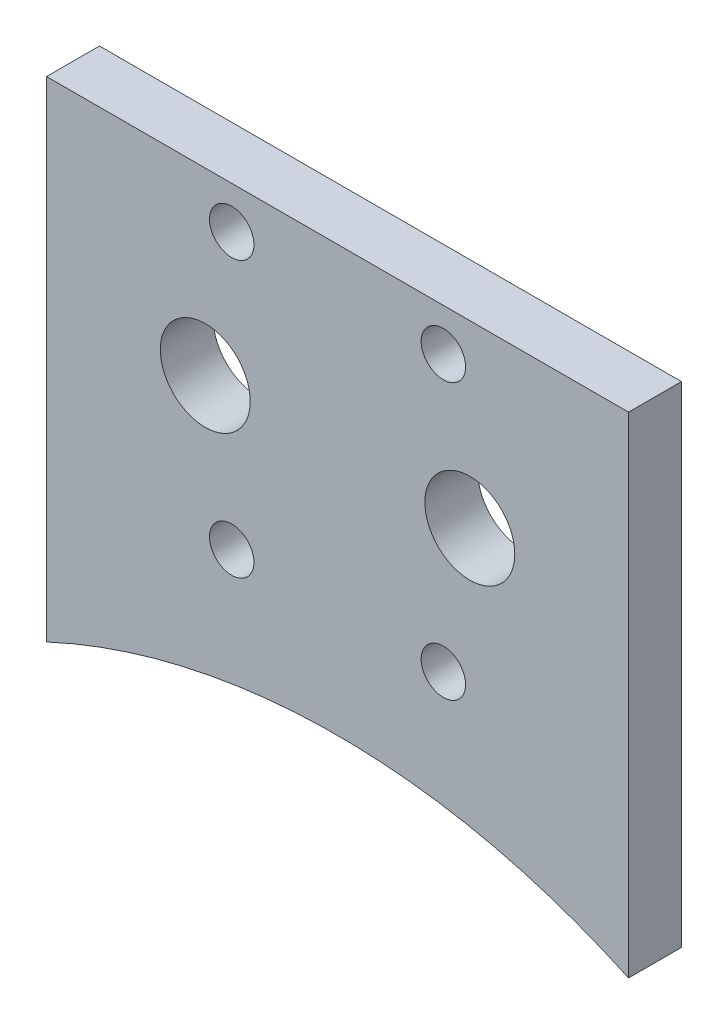
ISO-10303-21;
HEADER;
FILE_DESCRIPTION(('STEP AP214'),'2;1');
FILE_NAME('part.step','',(''),(''),'','','');
FILE_SCHEMA(('AUTOMOTIVE_DESIGN { 1 0 10303 214 1 1 1 1 }'));
ENDSEC;
DATA;
#1=APPLICATION_CONTEXT('core data for automotive mechanical design processes');
#2=APPLICATION_PROTOCOL_DEFINITION('international standard','automotive_design',2000,#1);
#3=PRODUCT_CONTEXT('',#1,'mechanical');
#4=PRODUCT('Part','Part','',(#3));
#5=PRODUCT_RELATED_PRODUCT_CATEGORY('part','',(#4));
#6=PRODUCT_DEFINITION_FORMATION('','',#4);
#7=PRODUCT_DEFINITION_CONTEXT('part definition',#1,'design');
#8=PRODUCT_DEFINITION('design','',#6,#7);
#9=PRODUCT_DEFINITION_SHAPE('','',#8);
#10=(LENGTH_UNIT() NAMED_UNIT(*) SI_UNIT(.MILLI.,.METRE.));
#11=(NAMED_UNIT(*) PLANE_ANGLE_UNIT() SI_UNIT($,.RADIAN.));
#12=(NAMED_UNIT(*) SI_UNIT($,.STERADIAN.) SOLID_ANGLE_UNIT());
#13=UNCERTAINTY_MEASURE_WITH_UNIT(LENGTH_MEASURE(1.E-05),#10,'distance_accuracy_value','');
#14=(GEOMETRIC_REPRESENTATION_CONTEXT(3) GLOBAL_UNCERTAINTY_ASSIGNED_CONTEXT((#13)) GLOBAL_UNIT_ASSIGNED_CONTEXT((#10,
#11,#12)) REPRESENTATION_CONTEXT('',''));
#15=CARTESIAN_POINT('',(0.,0.,0.));
#16=DIRECTION('',(0.,0.,1.));
#17=DIRECTION('',(1.,0.,0.));
#18=AXIS2_PLACEMENT_3D('',#15,#16,#17);
#19=CARTESIAN_POINT('',(0.0823984615384559,-88.7275100518437,5.));
#20=DIRECTION('',(0.,0.,1.));
#21=DIRECTION('',(1.,0.,0.));
#22=AXIS2_PLACEMENT_3D('',#19,#20,#21);
#23=PLANE('',#22);
#24=DIRECTION('',(-0.999999793655865,-0.000642408146284538,0.));
#25=VECTOR('',#24,1.);
#26=CARTESIAN_POINT('',(-27.4176015384619,16.4448156377795,5.));
#27=LINE('',#26,#25);
#28=CARTESIAN_POINT('',(27.5823984615396,16.4801480931158,5.));
#29=VERTEX_POINT('',#28);
#30=CARTESIAN_POINT('',(-27.4176015384619,16.4448156377795,5.));
#31=VERTEX_POINT('',#30);
#32=EDGE_CURVE('E71',#29,#31,#27,.T.);
#33=ORIENTED_EDGE('',*,*,#32,.T.);
#34=DIRECTION('',(0.,1.,0.));
#35=VECTOR('',#34,1.);
#36=CARTESIAN_POINT('',(-27.4176015384619,30.1685848951049,5.));
#37=LINE('',#36,#35);
#38=CARTESIAN_POINT('',(-27.4176015384619,-29.8314151048951,5.));
#39=VERTEX_POINT('',#38);
#40=EDGE_CURVE('E93',#39,#31,#37,.T.);
#41=ORIENTED_EDGE('',*,*,#40,.F.);
#42=CARTESIAN_POINT('',(0.0823984615384559,-88.7275100518437,5.));
#43=DIRECTION('',(0.,0.,-1.));
#44=DIRECTION('',(1.,0.,0.));
#45=AXIS2_PLACEMENT_3D('',#42,#43,#44);
#46=CIRCLE('',#45,65.);
#47=CARTESIAN_POINT('',(27.5823984615396,-29.8314151048951,5.));
#48=VERTEX_POINT('',#47);
#49=EDGE_CURVE('E91',#39,#48,#46,.T.);
#50=ORIENTED_EDGE('',*,*,#49,.T.);
#51=DIRECTION('',(0.,-1.,0.));
#52=VECTOR('',#51,1.);
#53=CARTESIAN_POINT('',(27.5823984615396,30.1685848951049,5.));
#54=LINE('',#53,#52);
#55=EDGE_CURVE('E85',#29,#48,#54,.T.);
#56=ORIENTED_EDGE('',*,*,#55,.F.);
#57=EDGE_LOOP('',(#33,#41,#50,#56));
#58=FACE_BOUND('',#57,.T.);
#59=CARTESIAN_POINT('',(-9.91760153846116,12.4801480931158,5.));
#60=DIRECTION('',(0.,0.,1.));
#61=DIRECTION('',(1.,0.,0.));
#62=AXIS2_PLACEMENT_3D('',#59,#60,#61);
#63=CIRCLE('',#62,2.1);
#64=CARTESIAN_POINT('',(-7.81760153846116,12.4801480931158,5.));
#65=VERTEX_POINT('',#64);
#66=EDGE_CURVE('E107',#65,#65,#63,.T.);
#67=ORIENTED_EDGE('',*,*,#66,.F.);
#68=EDGE_LOOP('',(#67));
#69=FACE_BOUND('',#68,.T.);
#70=CARTESIAN_POINT('',(-9.91760153846117,-13.5198519068842,5.));
#71=DIRECTION('',(0.,0.,1.));
#72=DIRECTION('',(1.,0.,0.));
#73=AXIS2_PLACEMENT_3D('',#70,#71,#72);
#74=CIRCLE('',#73,2.09999999999999);
#75=CARTESIAN_POINT('',(-7.81760153846118,-13.5198519068842,5.));
#76=VERTEX_POINT('',#75);
#77=EDGE_CURVE('E119',#76,#76,#74,.T.);
#78=ORIENTED_EDGE('',*,*,#77,.F.);
#79=EDGE_LOOP('',(#78));
#80=FACE_BOUND('',#79,.T.);
#81=CARTESIAN_POINT('',(12.5823984615388,-0.519851906884222,5.));
#82=DIRECTION('',(0.,0.,1.));
#83=DIRECTION('',(1.,0.,0.));
#84=AXIS2_PLACEMENT_3D('',#81,#82,#83);
#85=CIRCLE('',#84,4.25);
#86=CARTESIAN_POINT('',(16.8323984615388,-0.519851906884222,5.));
#87=VERTEX_POINT('',#86);
#88=EDGE_CURVE('E131',#87,#87,#85,.T.);
#89=ORIENTED_EDGE('',*,*,#88,.F.);
#90=EDGE_LOOP('',(#89));
#91=FACE_BOUND('',#90,.T.);
#92=CARTESIAN_POINT('',(10.0823984615388,-13.5198519068842,5.));
#93=DIRECTION('',(0.,0.,1.));
#94=DIRECTION('',(1.,0.,0.));
#95=AXIS2_PLACEMENT_3D('',#92,#93,#94);
#96=CIRCLE('',#95,2.1);
#97=CARTESIAN_POINT('',(12.1823984615388,-13.5198519068842,5.));
#98=VERTEX_POINT('',#97);
#99=EDGE_CURVE('E125',#98,#98,#96,.T.);
#100=ORIENTED_EDGE('',*,*,#99,.F.);
#101=EDGE_LOOP('',(#100));
#102=FACE_BOUND('',#101,.T.);
#103=CARTESIAN_POINT('',(-12.4176015384612,-0.519851906884215,5.));
#104=DIRECTION('',(0.,0.,1.));
#105=DIRECTION('',(1.,0.,0.));
#106=AXIS2_PLACEMENT_3D('',#103,#104,#105);
#107=CIRCLE('',#106,4.25);
#108=CARTESIAN_POINT('',(-8.16760153846116,-0.519851906884215,5.));
#109=VERTEX_POINT('',#108);
#110=EDGE_CURVE('E113',#109,#109,#107,.T.);
#111=ORIENTED_EDGE('',*,*,#110,.F.);
#112=EDGE_LOOP('',(#111));
#113=FACE_BOUND('',#112,.T.);
#114=CARTESIAN_POINT('',(10.0823984615388,12.4801480931158,5.));
#115=DIRECTION('',(0.,0.,1.));
#116=DIRECTION('',(1.,0.,0.));
#117=AXIS2_PLACEMENT_3D('',#114,#115,#116);
#118=CIRCLE('',#117,2.09999999999999);
#119=CARTESIAN_POINT('',(12.1823984615388,12.4801480931158,5.));
#120=VERTEX_POINT('',#119);
#121=EDGE_CURVE('E101',#120,#120,#118,.T.);
#122=ORIENTED_EDGE('',*,*,#121,.F.);
#123=EDGE_LOOP('',(#122));
#124=FACE_BOUND('',#123,.T.);
#125=ADVANCED_FACE('F33',(#58,#69,#80,#91,#102,#113,#124),#23,.T.);
#126=CARTESIAN_POINT('',(0.0823984615384559,-88.7275100518437,0.));
#127=DIRECTION('',(0.,0.,1.));
#128=DIRECTION('',(1.,0.,0.));
#129=AXIS2_PLACEMENT_3D('',#126,#127,#128);
#130=PLANE('',#129);
#131=DIRECTION('',(0.,1.,0.));
#132=VECTOR('',#131,1.);
#133=CARTESIAN_POINT('',(-27.4176015384619,-88.7275100518437,0.));
#134=LINE('',#133,#132);
#135=CARTESIAN_POINT('',(-27.4176015384619,-29.8314151048951,0.));
#136=VERTEX_POINT('',#135);
#137=CARTESIAN_POINT('',(-27.4176015384619,16.4448156377795,0.));
#138=VERTEX_POINT('',#137);
#139=EDGE_CURVE('E55',#136,#138,#134,.T.);
#140=ORIENTED_EDGE('',*,*,#139,.T.);
#141=DIRECTION('',(-0.999999793655865,-0.000642408146284538,0.));
#142=VECTOR('',#141,1.);
#143=CARTESIAN_POINT('',(-27.4176015384619,16.4448156377795,0.));
#144=LINE('',#143,#142);
#145=CARTESIAN_POINT('',(27.5823984615396,16.4801480931158,0.));
#146=VERTEX_POINT('',#145);
#147=EDGE_CURVE('E48',#146,#138,#144,.T.);
#148=ORIENTED_EDGE('',*,*,#147,.F.);
#149=DIRECTION('',(0.,-1.,0.));
#150=VECTOR('',#149,1.);
#151=CARTESIAN_POINT('',(27.5823984615396,-88.7275100518437,0.));
#152=LINE('',#151,#150);
#153=CARTESIAN_POINT('',(27.5823984615396,-29.8314151048951,0.));
#154=VERTEX_POINT('',#153);
#155=EDGE_CURVE('E87',#146,#154,#152,.T.);
#156=ORIENTED_EDGE('',*,*,#155,.T.);
#157=CARTESIAN_POINT('',(0.0823984615384559,-88.7275100518437,0.));
#158=DIRECTION('',(0.,0.,-1.));
#159=DIRECTION('',(1.,0.,0.));
#160=AXIS2_PLACEMENT_3D('',#157,#158,#159);
#161=CIRCLE('',#160,65.);
#162=EDGE_CURVE('E134',#136,#154,#161,.T.);
#163=ORIENTED_EDGE('',*,*,#162,.F.);
#164=EDGE_LOOP('',(#140,#148,#156,#163));
#165=FACE_BOUND('',#164,.T.);
#166=CARTESIAN_POINT('',(12.5823984615388,-0.519851906884222,0.));
#167=DIRECTION('',(0.,0.,1.));
#168=DIRECTION('',(1.,0.,0.));
#169=AXIS2_PLACEMENT_3D('',#166,#167,#168);
#170=CIRCLE('',#169,4.25);
#171=CARTESIAN_POINT('',(16.8323984615388,-0.519851906884222,0.));
#172=VERTEX_POINT('',#171);
#173=EDGE_CURVE('E128',#172,#172,#170,.T.);
#174=ORIENTED_EDGE('',*,*,#173,.T.);
#175=EDGE_LOOP('',(#174));
#176=FACE_BOUND('',#175,.T.);
#177=CARTESIAN_POINT('',(10.0823984615388,-13.5198519068842,0.));
#178=DIRECTION('',(0.,0.,1.));
#179=DIRECTION('',(1.,0.,0.));
#180=AXIS2_PLACEMENT_3D('',#177,#178,#179);
#181=CIRCLE('',#180,2.1);
#182=CARTESIAN_POINT('',(12.1823984615388,-13.5198519068842,0.));
#183=VERTEX_POINT('',#182);
#184=EDGE_CURVE('E122',#183,#183,#181,.T.);
#185=ORIENTED_EDGE('',*,*,#184,.T.);
#186=EDGE_LOOP('',(#185));
#187=FACE_BOUND('',#186,.T.);
#188=CARTESIAN_POINT('',(-9.91760153846117,-13.5198519068842,0.));
#189=DIRECTION('',(0.,0.,1.));
#190=DIRECTION('',(1.,0.,0.));
#191=AXIS2_PLACEMENT_3D('',#188,#189,#190);
#192=CIRCLE('',#191,2.09999999999999);
#193=CARTESIAN_POINT('',(-7.81760153846118,-13.5198519068842,0.));
#194=VERTEX_POINT('',#193);
#195=EDGE_CURVE('E116',#194,#194,#192,.T.);
#196=ORIENTED_EDGE('',*,*,#195,.T.);
#197=EDGE_LOOP('',(#196));
#198=FACE_BOUND('',#197,.T.);
#199=CARTESIAN_POINT('',(-12.4176015384612,-0.519851906884215,0.));
#200=DIRECTION('',(0.,0.,1.));
#201=DIRECTION('',(1.,0.,0.));
#202=AXIS2_PLACEMENT_3D('',#199,#200,#201);
#203=CIRCLE('',#202,4.25);
#204=CARTESIAN_POINT('',(-8.16760153846116,-0.519851906884215,0.));
#205=VERTEX_POINT('',#204);
#206=EDGE_CURVE('E110',#205,#205,#203,.T.);
#207=ORIENTED_EDGE('',*,*,#206,.T.);
#208=EDGE_LOOP('',(#207));
#209=FACE_BOUND('',#208,.T.);
#210=CARTESIAN_POINT('',(-9.91760153846116,12.4801480931158,0.));
#211=DIRECTION('',(0.,0.,1.));
#212=DIRECTION('',(1.,0.,0.));
#213=AXIS2_PLACEMENT_3D('',#210,#211,#212);
#214=CIRCLE('',#213,2.1);
#215=CARTESIAN_POINT('',(-7.81760153846116,12.4801480931158,0.));
#216=VERTEX_POINT('',#215);
#217=EDGE_CURVE('E104',#216,#216,#214,.T.);
#218=ORIENTED_EDGE('',*,*,#217,.T.);
#219=EDGE_LOOP('',(#218));
#220=FACE_BOUND('',#219,.T.);
#221=CARTESIAN_POINT('',(10.0823984615388,12.4801480931158,0.));
#222=DIRECTION('',(0.,0.,1.));
#223=DIRECTION('',(1.,0.,0.));
#224=AXIS2_PLACEMENT_3D('',#221,#222,#223);
#225=CIRCLE('',#224,2.09999999999999);
#226=CARTESIAN_POINT('',(12.1823984615388,12.4801480931158,0.));
#227=VERTEX_POINT('',#226);
#228=EDGE_CURVE('E100',#227,#227,#225,.T.);
#229=ORIENTED_EDGE('',*,*,#228,.T.);
#230=EDGE_LOOP('',(#229));
#231=FACE_BOUND('',#230,.T.);
#232=ADVANCED_FACE('F142',(#165,#176,#187,#198,#209,#220,#231),#130,.F.);
#233=CARTESIAN_POINT('',(0.0823984615384559,-88.7275100518437,5.));
#234=DIRECTION('',(0.,0.,-1.));
#235=DIRECTION('',(-1.,0.,0.));
#236=AXIS2_PLACEMENT_3D('',#233,#234,#235);
#237=CYLINDRICAL_SURFACE('',#236,65.);
#238=ORIENTED_EDGE('',*,*,#162,.T.);
#239=DIRECTION('',(0.,0.,-1.));
#240=VECTOR('',#239,1.);
#241=CARTESIAN_POINT('',(27.5823984615388,-29.8314151048951,5.));
#242=LINE('',#241,#240);
#243=EDGE_CURVE('E41',#48,#154,#242,.T.);
#244=ORIENTED_EDGE('',*,*,#243,.F.);
#245=ORIENTED_EDGE('',*,*,#49,.F.);
#246=DIRECTION('',(0.,0.,-1.));
#247=VECTOR('',#246,1.);
#248=CARTESIAN_POINT('',(-27.4176015384619,-29.8314151048951,5.));
#249=LINE('',#248,#247);
#250=EDGE_CURVE('E11',#39,#136,#249,.T.);
#251=ORIENTED_EDGE('',*,*,#250,.T.);
#252=EDGE_LOOP('',(#238,#244,#245,#251));
#253=FACE_BOUND('',#252,.T.);
#254=ADVANCED_FACE('F35',(#253),#237,.F.);
#255=CARTESIAN_POINT('',(12.5823984615388,-0.519851906884222,5.));
#256=DIRECTION('',(0.,0.,-1.));
#257=DIRECTION('',(-1.,0.,0.));
#258=AXIS2_PLACEMENT_3D('',#255,#256,#257);
#259=CYLINDRICAL_SURFACE('',#258,4.25);
#260=ORIENTED_EDGE('',*,*,#88,.T.);
#261=EDGE_LOOP('',(#260));
#262=FACE_BOUND('',#261,.T.);
#263=ORIENTED_EDGE('',*,*,#173,.F.);
#264=EDGE_LOOP('',(#263));
#265=FACE_BOUND('',#264,.T.);
#266=ADVANCED_FACE('F179',(#262,#265),#259,.F.);
#267=CARTESIAN_POINT('',(10.0823984615388,-13.5198519068842,5.));
#268=DIRECTION('',(0.,0.,-1.));
#269=DIRECTION('',(-1.,0.,0.));
#270=AXIS2_PLACEMENT_3D('',#267,#268,#269);
#271=CYLINDRICAL_SURFACE('',#270,2.1);
#272=ORIENTED_EDGE('',*,*,#99,.T.);
#273=EDGE_LOOP('',(#272));
#274=FACE_BOUND('',#273,.T.);
#275=ORIENTED_EDGE('',*,*,#184,.F.);
#276=EDGE_LOOP('',(#275));
#277=FACE_BOUND('',#276,.T.);
#278=ADVANCED_FACE('F182',(#274,#277),#271,.F.);
#279=CARTESIAN_POINT('',(-9.91760153846117,-13.5198519068842,5.));
#280=DIRECTION('',(0.,0.,-1.));
#281=DIRECTION('',(-1.,0.,0.));
#282=AXIS2_PLACEMENT_3D('',#279,#280,#281);
#283=CYLINDRICAL_SURFACE('',#282,2.09999999999999);
#284=ORIENTED_EDGE('',*,*,#77,.T.);
#285=EDGE_LOOP('',(#284));
#286=FACE_BOUND('',#285,.T.);
#287=ORIENTED_EDGE('',*,*,#195,.F.);
#288=EDGE_LOOP('',(#287));
#289=FACE_BOUND('',#288,.T.);
#290=ADVANCED_FACE('F186',(#286,#289),#283,.F.);
#291=CARTESIAN_POINT('',(-12.4176015384612,-0.519851906884215,5.));
#292=DIRECTION('',(0.,0.,-1.));
#293=DIRECTION('',(-1.,0.,0.));
#294=AXIS2_PLACEMENT_3D('',#291,#292,#293);
#295=CYLINDRICAL_SURFACE('',#294,4.25);
#296=ORIENTED_EDGE('',*,*,#110,.T.);
#297=EDGE_LOOP('',(#296));
#298=FACE_BOUND('',#297,.T.);
#299=ORIENTED_EDGE('',*,*,#206,.F.);
#300=EDGE_LOOP('',(#299));
#301=FACE_BOUND('',#300,.T.);
#302=ADVANCED_FACE('F170',(#298,#301),#295,.F.);
#303=CARTESIAN_POINT('',(-9.91760153846116,12.4801480931158,5.));
#304=DIRECTION('',(0.,0.,-1.));
#305=DIRECTION('',(-1.,0.,0.));
#306=AXIS2_PLACEMENT_3D('',#303,#304,#305);
#307=CYLINDRICAL_SURFACE('',#306,2.1);
#308=ORIENTED_EDGE('',*,*,#66,.T.);
#309=EDGE_LOOP('',(#308));
#310=FACE_BOUND('',#309,.T.);
#311=ORIENTED_EDGE('',*,*,#217,.F.);
#312=EDGE_LOOP('',(#311));
#313=FACE_BOUND('',#312,.T.);
#314=ADVANCED_FACE('F160',(#310,#313),#307,.F.);
#315=CARTESIAN_POINT('',(10.0823984615388,12.4801480931158,5.));
#316=DIRECTION('',(0.,0.,-1.));
#317=DIRECTION('',(-1.,0.,0.));
#318=AXIS2_PLACEMENT_3D('',#315,#316,#317);
#319=CYLINDRICAL_SURFACE('',#318,2.09999999999999);
#320=ORIENTED_EDGE('',*,*,#121,.T.);
#321=EDGE_LOOP('',(#320));
#322=FACE_BOUND('',#321,.T.);
#323=ORIENTED_EDGE('',*,*,#228,.F.);
#324=EDGE_LOOP('',(#323));
#325=FACE_BOUND('',#324,.T.);
#326=ADVANCED_FACE('F158',(#322,#325),#319,.F.);
#327=CARTESIAN_POINT('',(27.5823984615396,30.1685848951049,-5.));
#328=DIRECTION('',(-1.,0.,0.));
#329=DIRECTION('',(0.,0.,1.));
#330=AXIS2_PLACEMENT_3D('',#327,#328,#329);
#331=PLANE('',#330);
#332=ORIENTED_EDGE('',*,*,#155,.F.);
#333=DIRECTION('',(0.,0.,-1.));
#334=VECTOR('',#333,1.);
#335=CARTESIAN_POINT('',(27.5823984615396,16.4801480931158,5.));
#336=LINE('',#335,#334);
#337=EDGE_CURVE('E74',#29,#146,#336,.T.);
#338=ORIENTED_EDGE('',*,*,#337,.F.);
#339=ORIENTED_EDGE('',*,*,#55,.T.);
#340=ORIENTED_EDGE('',*,*,#243,.T.);
#341=EDGE_LOOP('',(#332,#338,#339,#340));
#342=FACE_BOUND('',#341,.T.);
#343=ADVANCED_FACE('F83',(#342),#331,.F.);
#344=CARTESIAN_POINT('',(-27.4176015384619,30.1685848951049,-5.));
#345=DIRECTION('',(1.,0.,0.));
#346=DIRECTION('',(0.,0.,-1.));
#347=AXIS2_PLACEMENT_3D('',#344,#345,#346);
#348=PLANE('',#347);
#349=ORIENTED_EDGE('',*,*,#40,.T.);
#350=DIRECTION('',(0.,0.,-1.));
#351=VECTOR('',#350,1.);
#352=CARTESIAN_POINT('',(-27.4176015384619,16.4448156377795,5.));
#353=LINE('',#352,#351);
#354=EDGE_CURVE('E75',#31,#138,#353,.T.);
#355=ORIENTED_EDGE('',*,*,#354,.T.);
#356=ORIENTED_EDGE('',*,*,#139,.F.);
#357=ORIENTED_EDGE('',*,*,#250,.F.);
#358=EDGE_LOOP('',(#349,#355,#356,#357));
#359=FACE_BOUND('',#358,.T.);
#360=ADVANCED_FACE('F168',(#359),#348,.F.);
#361=CARTESIAN_POINT('',(-27.4176015384619,16.4448156377795,5.));
#362=DIRECTION('',(0.000642408146284538,-0.999999793655866,0.));
#363=DIRECTION('',(0.999999793655866,0.000642408146284538,0.));
#364=AXIS2_PLACEMENT_3D('',#361,#362,#363);
#365=PLANE('',#364);
#366=ORIENTED_EDGE('',*,*,#147,.T.);
#367=ORIENTED_EDGE('',*,*,#354,.F.);
#368=ORIENTED_EDGE('',*,*,#32,.F.);
#369=ORIENTED_EDGE('',*,*,#337,.T.);
#370=EDGE_LOOP('',(#366,#367,#368,#369));
#371=FACE_BOUND('',#370,.T.);
#372=ADVANCED_FACE('F73',(#371),#365,.F.);
#373=CLOSED_SHELL('',(#125,#232,#254,#266,#278,#290,#302,#314,#326,#343,#360,#372));
#374=MANIFOLD_SOLID_BREP('B2',#373);
#375=ADVANCED_BREP_SHAPE_REPRESENTATION('',(#18,#374),#14);
#376=SHAPE_DEFINITION_REPRESENTATION(#9,#375);
ENDSEC;
END-ISO-10303-21;
